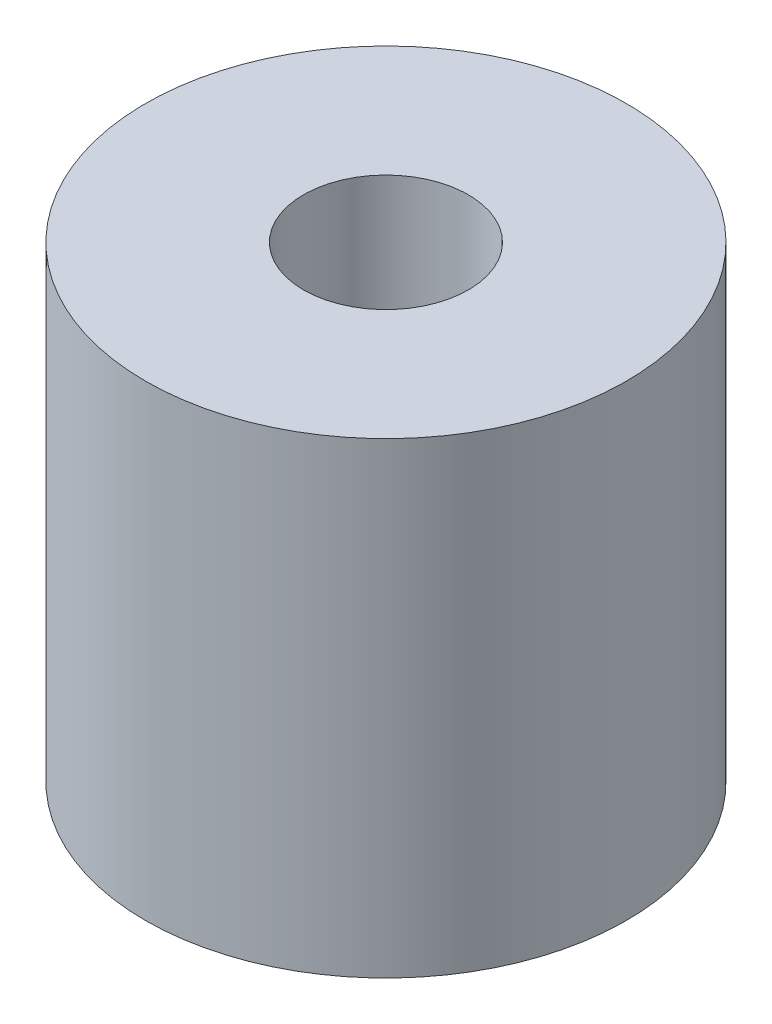
ISO-10303-21;
HEADER;
FILE_DESCRIPTION(('STEP AP214'),'2;1');
FILE_NAME('part.step','',(''),(''),'','','');
FILE_SCHEMA(('AUTOMOTIVE_DESIGN { 1 0 10303 214 1 1 1 1 }'));
ENDSEC;
DATA;
#1=APPLICATION_CONTEXT('core data for automotive mechanical design processes');
#2=APPLICATION_PROTOCOL_DEFINITION('international standard','automotive_design',2000,#1);
#3=PRODUCT_CONTEXT('',#1,'mechanical');
#4=PRODUCT('Part','Part','',(#3));
#5=PRODUCT_RELATED_PRODUCT_CATEGORY('part','',(#4));
#6=PRODUCT_DEFINITION_FORMATION('','',#4);
#7=PRODUCT_DEFINITION_CONTEXT('part definition',#1,'design');
#8=PRODUCT_DEFINITION('design','',#6,#7);
#9=PRODUCT_DEFINITION_SHAPE('','',#8);
#10=(LENGTH_UNIT() NAMED_UNIT(*) SI_UNIT(.MILLI.,.METRE.));
#11=(NAMED_UNIT(*) PLANE_ANGLE_UNIT() SI_UNIT($,.RADIAN.));
#12=(NAMED_UNIT(*) SI_UNIT($,.STERADIAN.) SOLID_ANGLE_UNIT());
#13=UNCERTAINTY_MEASURE_WITH_UNIT(LENGTH_MEASURE(1.E-05),#10,'distance_accuracy_value','');
#14=(GEOMETRIC_REPRESENTATION_CONTEXT(3) GLOBAL_UNCERTAINTY_ASSIGNED_CONTEXT((#13)) GLOBAL_UNIT_ASSIGNED_CONTEXT((#10,
#11,#12)) REPRESENTATION_CONTEXT('',''));
#15=CARTESIAN_POINT('',(0.,0.,0.));
#16=DIRECTION('',(0.,0.,1.));
#17=DIRECTION('',(1.,0.,0.));
#18=AXIS2_PLACEMENT_3D('',#15,#16,#17);
#19=CARTESIAN_POINT('',(0.,68.,0.));
#20=DIRECTION('',(0.,1.,0.));
#21=DIRECTION('',(0.,0.,1.));
#22=AXIS2_PLACEMENT_3D('',#19,#20,#21);
#23=PLANE('',#22);
#24=CARTESIAN_POINT('',(0.,68.,0.));
#25=DIRECTION('',(0.,1.,0.));
#26=DIRECTION('',(0.,0.,1.));
#27=AXIS2_PLACEMENT_3D('',#24,#25,#26);
#28=CIRCLE('',#27,35.);
#29=CARTESIAN_POINT('',(0.,68.,35.));
#30=VERTEX_POINT('',#29);
#31=EDGE_CURVE('E10',#30,#30,#28,.T.);
#32=ORIENTED_EDGE('',*,*,#31,.T.);
#33=EDGE_LOOP('',(#32));
#34=FACE_BOUND('',#33,.T.);
#35=CARTESIAN_POINT('',(0.,68.,0.));
#36=DIRECTION('',(0.,1.,0.));
#37=DIRECTION('',(0.,0.,1.));
#38=AXIS2_PLACEMENT_3D('',#35,#36,#37);
#39=CIRCLE('',#38,12.);
#40=CARTESIAN_POINT('',(0.,68.,12.));
#41=VERTEX_POINT('',#40);
#42=EDGE_CURVE('E42',#41,#41,#39,.T.);
#43=ORIENTED_EDGE('',*,*,#42,.F.);
#44=EDGE_LOOP('',(#43));
#45=FACE_BOUND('',#44,.T.);
#46=ADVANCED_FACE('F31',(#34,#45),#23,.T.);
#47=CARTESIAN_POINT('',(0.,0.,0.));
#48=DIRECTION('',(0.,1.,0.));
#49=DIRECTION('',(0.,0.,1.));
#50=AXIS2_PLACEMENT_3D('',#47,#48,#49);
#51=PLANE('',#50);
#52=CARTESIAN_POINT('',(0.,0.,0.));
#53=DIRECTION('',(0.,1.,0.));
#54=DIRECTION('',(0.,0.,1.));
#55=AXIS2_PLACEMENT_3D('',#52,#53,#54);
#56=CIRCLE('',#55,35.);
#57=CARTESIAN_POINT('',(0.,0.,35.));
#58=VERTEX_POINT('',#57);
#59=EDGE_CURVE('E35',#58,#58,#56,.T.);
#60=ORIENTED_EDGE('',*,*,#59,.F.);
#61=EDGE_LOOP('',(#60));
#62=FACE_BOUND('',#61,.T.);
#63=CARTESIAN_POINT('',(0.,0.,0.));
#64=DIRECTION('',(0.,1.,0.));
#65=DIRECTION('',(0.,0.,1.));
#66=AXIS2_PLACEMENT_3D('',#63,#64,#65);
#67=CIRCLE('',#66,12.);
#68=CARTESIAN_POINT('',(0.,0.,12.));
#69=VERTEX_POINT('',#68);
#70=EDGE_CURVE('E44',#69,#69,#67,.T.);
#71=ORIENTED_EDGE('',*,*,#70,.T.);
#72=EDGE_LOOP('',(#71));
#73=FACE_BOUND('',#72,.T.);
#74=ADVANCED_FACE('F54',(#62,#73),#51,.F.);
#75=CARTESIAN_POINT('',(0.,68.,0.));
#76=DIRECTION('',(0.,-1.,0.));
#77=DIRECTION('',(0.,0.,-1.));
#78=AXIS2_PLACEMENT_3D('',#75,#76,#77);
#79=CYLINDRICAL_SURFACE('',#78,35.);
#80=ORIENTED_EDGE('',*,*,#31,.F.);
#81=EDGE_LOOP('',(#80));
#82=FACE_BOUND('',#81,.T.);
#83=ORIENTED_EDGE('',*,*,#59,.T.);
#84=EDGE_LOOP('',(#83));
#85=FACE_BOUND('',#84,.T.);
#86=ADVANCED_FACE('F33',(#82,#85),#79,.T.);
#87=CARTESIAN_POINT('',(0.,68.,0.));
#88=DIRECTION('',(0.,-1.,0.));
#89=DIRECTION('',(0.,0.,-1.));
#90=AXIS2_PLACEMENT_3D('',#87,#88,#89);
#91=CYLINDRICAL_SURFACE('',#90,12.);
#92=ORIENTED_EDGE('',*,*,#42,.T.);
#93=EDGE_LOOP('',(#92));
#94=FACE_BOUND('',#93,.T.);
#95=ORIENTED_EDGE('',*,*,#70,.F.);
#96=EDGE_LOOP('',(#95));
#97=FACE_BOUND('',#96,.T.);
#98=ADVANCED_FACE('F50',(#94,#97),#91,.F.);
#99=CLOSED_SHELL('',(#46,#74,#86,#98));
#100=MANIFOLD_SOLID_BREP('B2',#99);
#101=ADVANCED_BREP_SHAPE_REPRESENTATION('',(#18,#100),#14);
#102=SHAPE_DEFINITION_REPRESENTATION(#9,#101);
ENDSEC;
END-ISO-10303-21;
